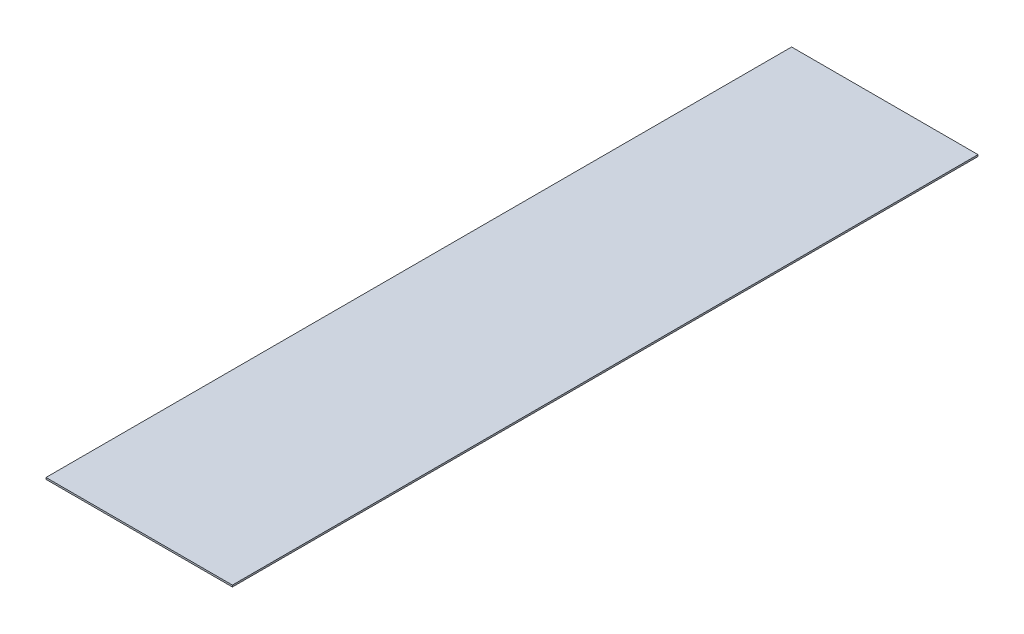
ISO-10303-21;
HEADER;
FILE_DESCRIPTION(('STEP AP214'),'2;1');
FILE_NAME('part.step','',(''),(''),'','','');
FILE_SCHEMA(('AUTOMOTIVE_DESIGN { 1 0 10303 214 1 1 1 1 }'));
ENDSEC;
DATA;
#1=APPLICATION_CONTEXT('core data for automotive mechanical design processes');
#2=APPLICATION_PROTOCOL_DEFINITION('international standard','automotive_design',2000,#1);
#3=PRODUCT_CONTEXT('',#1,'mechanical');
#4=PRODUCT('Part','Part','',(#3));
#5=PRODUCT_RELATED_PRODUCT_CATEGORY('part','',(#4));
#6=PRODUCT_DEFINITION_FORMATION('','',#4);
#7=PRODUCT_DEFINITION_CONTEXT('part definition',#1,'design');
#8=PRODUCT_DEFINITION('design','',#6,#7);
#9=PRODUCT_DEFINITION_SHAPE('','',#8);
#10=(LENGTH_UNIT() NAMED_UNIT(*) SI_UNIT(.MILLI.,.METRE.));
#11=(NAMED_UNIT(*) PLANE_ANGLE_UNIT() SI_UNIT($,.RADIAN.));
#12=(NAMED_UNIT(*) SI_UNIT($,.STERADIAN.) SOLID_ANGLE_UNIT());
#13=UNCERTAINTY_MEASURE_WITH_UNIT(LENGTH_MEASURE(1.E-05),#10,'distance_accuracy_value','');
#14=(GEOMETRIC_REPRESENTATION_CONTEXT(3) GLOBAL_UNCERTAINTY_ASSIGNED_CONTEXT((#13)) GLOBAL_UNIT_ASSIGNED_CONTEXT((#10,
#11,#12)) REPRESENTATION_CONTEXT('',''));
#15=CARTESIAN_POINT('',(0.,0.,0.));
#16=DIRECTION('',(0.,0.,1.));
#17=DIRECTION('',(1.,0.,0.));
#18=AXIS2_PLACEMENT_3D('',#15,#16,#17);
#19=CARTESIAN_POINT('',(304.8,5.55625,1219.2));
#20=DIRECTION('',(-1.,0.,0.));
#21=DIRECTION('',(0.,0.,1.));
#22=AXIS2_PLACEMENT_3D('',#19,#20,#21);
#23=PLANE('',#22);
#24=DIRECTION('',(0.,0.,-1.));
#25=VECTOR('',#24,1.);
#26=CARTESIAN_POINT('',(304.8,0.,1219.2));
#27=LINE('',#26,#25);
#28=CARTESIAN_POINT('',(304.8,0.,1219.2));
#29=VERTEX_POINT('',#28);
#30=CARTESIAN_POINT('',(304.8,0.,-1219.2));
#31=VERTEX_POINT('',#30);
#32=EDGE_CURVE('E102',#29,#31,#27,.T.);
#33=ORIENTED_EDGE('',*,*,#32,.T.);
#34=DIRECTION('',(0.,-1.,0.));
#35=VECTOR('',#34,1.);
#36=CARTESIAN_POINT('',(304.8,5.55625,-1219.2));
#37=LINE('',#36,#35);
#38=CARTESIAN_POINT('',(304.8,5.55625,-1219.2));
#39=VERTEX_POINT('',#38);
#40=EDGE_CURVE('E11',#39,#31,#37,.T.);
#41=ORIENTED_EDGE('',*,*,#40,.F.);
#42=DIRECTION('',(0.,0.,-1.));
#43=VECTOR('',#42,1.);
#44=CARTESIAN_POINT('',(304.8,5.55625,1219.2));
#45=LINE('',#44,#43);
#46=CARTESIAN_POINT('',(304.8,5.55625,1219.2));
#47=VERTEX_POINT('',#46);
#48=EDGE_CURVE('E90',#47,#39,#45,.T.);
#49=ORIENTED_EDGE('',*,*,#48,.F.);
#50=DIRECTION('',(0.,-1.,0.));
#51=VECTOR('',#50,1.);
#52=CARTESIAN_POINT('',(304.8,5.55625,1219.2));
#53=LINE('',#52,#51);
#54=EDGE_CURVE('E98',#47,#29,#53,.T.);
#55=ORIENTED_EDGE('',*,*,#54,.T.);
#56=EDGE_LOOP('',(#33,#41,#49,#55));
#57=FACE_BOUND('',#56,.T.);
#58=ADVANCED_FACE('F39',(#57),#23,.F.);
#59=CARTESIAN_POINT('',(-304.8,5.55625,-1219.2));
#60=DIRECTION('',(0.,0.,1.));
#61=DIRECTION('',(1.,0.,0.));
#62=AXIS2_PLACEMENT_3D('',#59,#60,#61);
#63=PLANE('',#62);
#64=DIRECTION('',(-1.,0.,0.));
#65=VECTOR('',#64,1.);
#66=CARTESIAN_POINT('',(-304.8,0.,-1219.2));
#67=LINE('',#66,#65);
#68=CARTESIAN_POINT('',(-304.8,0.,-1219.2));
#69=VERTEX_POINT('',#68);
#70=EDGE_CURVE('E94',#31,#69,#67,.T.);
#71=ORIENTED_EDGE('',*,*,#70,.T.);
#72=DIRECTION('',(0.,-1.,0.));
#73=VECTOR('',#72,1.);
#74=CARTESIAN_POINT('',(-304.8,5.55625,-1219.2));
#75=LINE('',#74,#73);
#76=CARTESIAN_POINT('',(-304.8,5.55625,-1219.2));
#77=VERTEX_POINT('',#76);
#78=EDGE_CURVE('E47',#77,#69,#75,.T.);
#79=ORIENTED_EDGE('',*,*,#78,.F.);
#80=DIRECTION('',(-1.,0.,0.));
#81=VECTOR('',#80,1.);
#82=CARTESIAN_POINT('',(-304.8,5.55625,-1219.2));
#83=LINE('',#82,#81);
#84=EDGE_CURVE('E85',#39,#77,#83,.T.);
#85=ORIENTED_EDGE('',*,*,#84,.F.);
#86=ORIENTED_EDGE('',*,*,#40,.T.);
#87=EDGE_LOOP('',(#71,#79,#85,#86));
#88=FACE_BOUND('',#87,.T.);
#89=ADVANCED_FACE('F93',(#88),#63,.F.);
#90=CARTESIAN_POINT('',(-304.8,5.55625,1219.2));
#91=DIRECTION('',(1.,0.,0.));
#92=DIRECTION('',(0.,0.,-1.));
#93=AXIS2_PLACEMENT_3D('',#90,#91,#92);
#94=PLANE('',#93);
#95=DIRECTION('',(0.,0.,1.));
#96=VECTOR('',#95,1.);
#97=CARTESIAN_POINT('',(-304.8,0.,1219.2));
#98=LINE('',#97,#96);
#99=CARTESIAN_POINT('',(-304.8,0.,1219.2));
#100=VERTEX_POINT('',#99);
#101=EDGE_CURVE('E72',#69,#100,#98,.T.);
#102=ORIENTED_EDGE('',*,*,#101,.T.);
#103=DIRECTION('',(0.,-1.,0.));
#104=VECTOR('',#103,1.);
#105=CARTESIAN_POINT('',(-304.8,5.55625,1219.2));
#106=LINE('',#105,#104);
#107=CARTESIAN_POINT('',(-304.8,5.55625,1219.2));
#108=VERTEX_POINT('',#107);
#109=EDGE_CURVE('E95',#108,#100,#106,.T.);
#110=ORIENTED_EDGE('',*,*,#109,.F.);
#111=DIRECTION('',(0.,0.,1.));
#112=VECTOR('',#111,1.);
#113=CARTESIAN_POINT('',(-304.8,5.55625,1219.2));
#114=LINE('',#113,#112);
#115=EDGE_CURVE('E88',#77,#108,#114,.T.);
#116=ORIENTED_EDGE('',*,*,#115,.F.);
#117=ORIENTED_EDGE('',*,*,#78,.T.);
#118=EDGE_LOOP('',(#102,#110,#116,#117));
#119=FACE_BOUND('',#118,.T.);
#120=ADVANCED_FACE('F96',(#119),#94,.F.);
#121=CARTESIAN_POINT('',(-304.8,5.55625,1219.2));
#122=DIRECTION('',(0.,0.,-1.));
#123=DIRECTION('',(-1.,0.,0.));
#124=AXIS2_PLACEMENT_3D('',#121,#122,#123);
#125=PLANE('',#124);
#126=DIRECTION('',(1.,0.,0.));
#127=VECTOR('',#126,1.);
#128=CARTESIAN_POINT('',(-304.8,0.,1219.2));
#129=LINE('',#128,#127);
#130=EDGE_CURVE('E78',#100,#29,#129,.T.);
#131=ORIENTED_EDGE('',*,*,#130,.T.);
#132=ORIENTED_EDGE('',*,*,#54,.F.);
#133=DIRECTION('',(1.,0.,0.));
#134=VECTOR('',#133,1.);
#135=CARTESIAN_POINT('',(-304.8,5.55625,1219.2));
#136=LINE('',#135,#134);
#137=EDGE_CURVE('E55',#108,#47,#136,.T.);
#138=ORIENTED_EDGE('',*,*,#137,.F.);
#139=ORIENTED_EDGE('',*,*,#109,.T.);
#140=EDGE_LOOP('',(#131,#132,#138,#139));
#141=FACE_BOUND('',#140,.T.);
#142=ADVANCED_FACE('F109',(#141),#125,.F.);
#143=CARTESIAN_POINT('',(0.,5.55625,0.));
#144=DIRECTION('',(0.,-1.,0.));
#145=DIRECTION('',(0.,0.,-1.));
#146=AXIS2_PLACEMENT_3D('',#143,#144,#145);
#147=PLANE('',#146);
#148=ORIENTED_EDGE('',*,*,#48,.T.);
#149=ORIENTED_EDGE('',*,*,#84,.T.);
#150=ORIENTED_EDGE('',*,*,#115,.T.);
#151=ORIENTED_EDGE('',*,*,#137,.T.);
#152=EDGE_LOOP('',(#148,#149,#150,#151));
#153=FACE_BOUND('',#152,.T.);
#154=ADVANCED_FACE('F86',(#153),#147,.F.);
#155=CARTESIAN_POINT('',(0.,0.,0.));
#156=DIRECTION('',(0.,-1.,0.));
#157=DIRECTION('',(0.,0.,-1.));
#158=AXIS2_PLACEMENT_3D('',#155,#156,#157);
#159=PLANE('',#158);
#160=ORIENTED_EDGE('',*,*,#32,.F.);
#161=ORIENTED_EDGE('',*,*,#130,.F.);
#162=ORIENTED_EDGE('',*,*,#101,.F.);
#163=ORIENTED_EDGE('',*,*,#70,.F.);
#164=EDGE_LOOP('',(#160,#161,#162,#163));
#165=FACE_BOUND('',#164,.T.);
#166=ADVANCED_FACE('F112',(#165),#159,.T.);
#167=CLOSED_SHELL('',(#58,#89,#120,#142,#154,#166));
#168=MANIFOLD_SOLID_BREP('B2',#167);
#169=ADVANCED_BREP_SHAPE_REPRESENTATION('',(#18,#168),#14);
#170=SHAPE_DEFINITION_REPRESENTATION(#9,#169);
ENDSEC;
END-ISO-10303-21;
